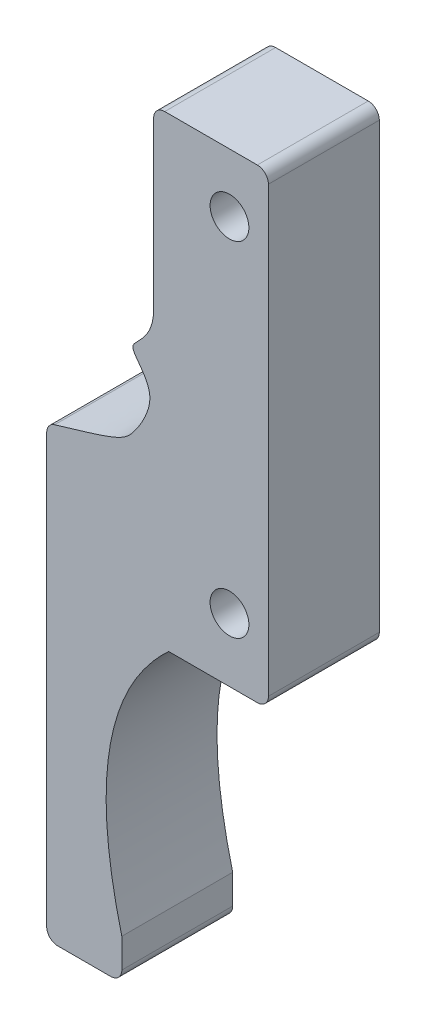
ISO-10303-21;
HEADER;
FILE_DESCRIPTION(('STEP AP214'),'2;1');
FILE_NAME('part.step','',(''),(''),'','','');
FILE_SCHEMA(('AUTOMOTIVE_DESIGN { 1 0 10303 214 1 1 1 1 }'));
ENDSEC;
DATA;
#1=APPLICATION_CONTEXT('core data for automotive mechanical design processes');
#2=APPLICATION_PROTOCOL_DEFINITION('international standard','automotive_design',2000,#1);
#3=PRODUCT_CONTEXT('',#1,'mechanical');
#4=PRODUCT('Part','Part','',(#3));
#5=PRODUCT_RELATED_PRODUCT_CATEGORY('part','',(#4));
#6=PRODUCT_DEFINITION_FORMATION('','',#4);
#7=PRODUCT_DEFINITION_CONTEXT('part definition',#1,'design');
#8=PRODUCT_DEFINITION('design','',#6,#7);
#9=PRODUCT_DEFINITION_SHAPE('','',#8);
#10=(LENGTH_UNIT() NAMED_UNIT(*) SI_UNIT(.MILLI.,.METRE.));
#11=(NAMED_UNIT(*) PLANE_ANGLE_UNIT() SI_UNIT($,.RADIAN.));
#12=(NAMED_UNIT(*) SI_UNIT($,.STERADIAN.) SOLID_ANGLE_UNIT());
#13=UNCERTAINTY_MEASURE_WITH_UNIT(LENGTH_MEASURE(1.E-05),#10,'distance_accuracy_value','');
#14=(GEOMETRIC_REPRESENTATION_CONTEXT(3) GLOBAL_UNCERTAINTY_ASSIGNED_CONTEXT((#13)) GLOBAL_UNIT_ASSIGNED_CONTEXT((#10,
#11,#12)) REPRESENTATION_CONTEXT('',''));
#15=CARTESIAN_POINT('',(0.,0.,0.));
#16=DIRECTION('',(0.,0.,1.));
#17=DIRECTION('',(1.,0.,0.));
#18=AXIS2_PLACEMENT_3D('',#15,#16,#17);
#19=CARTESIAN_POINT('',(81.4074976164815,110.958146332403,10.));
#20=DIRECTION('',(0.,0.,1.));
#21=DIRECTION('',(1.,0.,0.));
#22=AXIS2_PLACEMENT_3D('',#19,#20,#21);
#23=PLANE('',#22);
#24=CARTESIAN_POINT('',(78.8936057952045,106.672950268513,10.));
#25=DIRECTION('',(0.,0.,1.));
#26=DIRECTION('',(1.,0.,0.));
#27=AXIS2_PLACEMENT_3D('',#24,#25,#26);
#28=CIRCLE('',#27,1.75);
#29=CARTESIAN_POINT('',(80.6436057952045,106.672950268513,10.));
#30=VERTEX_POINT('',#29);
#31=EDGE_CURVE('E178',#30,#30,#28,.T.);
#32=ORIENTED_EDGE('',*,*,#31,.F.);
#33=EDGE_LOOP('',(#32));
#34=FACE_BOUND('',#33,.T.);
#35=CARTESIAN_POINT('',(81.4074976164815,110.958146332403,10.));
#36=DIRECTION('',(0.,0.,1.));
#37=DIRECTION('',(1.,0.,0.));
#38=AXIS2_PLACEMENT_3D('',#35,#36,#37);
#39=CIRCLE('',#38,1.);
#40=CARTESIAN_POINT('',(82.4074976164815,110.958146332403,10.));
#41=VERTEX_POINT('',#40);
#42=CARTESIAN_POINT('',(81.4074976164815,111.958146332403,10.));
#43=VERTEX_POINT('',#42);
#44=EDGE_CURVE('E213',#41,#43,#39,.T.);
#45=ORIENTED_EDGE('',*,*,#44,.T.);
#46=DIRECTION('',(-1.,0.,0.));
#47=VECTOR('',#46,1.);
#48=CARTESIAN_POINT('',(73.0536822358532,111.958146332403,10.));
#49=LINE('',#48,#47);
#50=CARTESIAN_POINT('',(73.0536822358532,111.958146332403,10.));
#51=VERTEX_POINT('',#50);
#52=EDGE_CURVE('E116',#43,#51,#49,.T.);
#53=ORIENTED_EDGE('',*,*,#52,.T.);
#54=CARTESIAN_POINT('',(73.0536822358532,110.958146332403,10.));
#55=DIRECTION('',(0.,0.,1.));
#56=DIRECTION('',(1.,0.,0.));
#57=AXIS2_PLACEMENT_3D('',#54,#55,#56);
#58=CIRCLE('',#57,1.);
#59=CARTESIAN_POINT('',(72.0536822358532,110.958146332403,10.));
#60=VERTEX_POINT('',#59);
#61=EDGE_CURVE('E249',#51,#60,#58,.T.);
#62=ORIENTED_EDGE('',*,*,#61,.T.);
#63=DIRECTION('',(0.,-1.,0.));
#64=VECTOR('',#63,1.);
#65=CARTESIAN_POINT('',(72.0536822358532,110.958146332403,10.));
#66=LINE('',#65,#64);
#67=CARTESIAN_POINT('',(72.0536822358532,96.0190924094982,10.));
#68=VERTEX_POINT('',#67);
#69=EDGE_CURVE('E268',#60,#68,#66,.T.);
#70=ORIENTED_EDGE('',*,*,#69,.T.);
#71=CARTESIAN_POINT('',(72.0536822358532,96.0190924094982,10.));
#72=CARTESIAN_POINT('',(72.0536822358532,93.5706000792391,10.));
#73=CARTESIAN_POINT('',(70.0021186185819,92.6664007553484,10.));
#74=CARTESIAN_POINT('',(70.3613429707541,91.3427097777105,10.));
#75=CARTESIAN_POINT('',(72.6197353641653,89.4424327734386,10.));
#76=CARTESIAN_POINT('',(70.7931183017576,86.1977075173196,10.));
#77=CARTESIAN_POINT('',(69.297708233434,84.3464227662319,10.));
#78=CARTESIAN_POINT('',(67.8216632749963,83.9233918157655,10.));
#79=CARTESIAN_POINT('',(63.1222194868842,82.5246168758891,10.));
#80=B_SPLINE_CURVE_WITH_KNOTS('',3,(#71,#72,#73,#74,#75,#76,#77,#78,#79),.UNSPECIFIED.,.F.,.F.,
(4,1,1,1,1,1,4),(0.0124698077563363,0.212188097159802,0.26070740571171,0.497662893275421,
0.694790388692906,0.745024099365364,1.),.UNSPECIFIED.);
#81=CARTESIAN_POINT('',(63.1222194868842,82.5246168758891,10.));
#82=VERTEX_POINT('',#81);
#83=EDGE_CURVE('E265',#68,#82,#80,.T.);
#84=ORIENTED_EDGE('',*,*,#83,.T.);
#85=CARTESIAN_POINT('',(63.4074976164816,81.5661720998204,10.));
#86=DIRECTION('',(0.,0.,1.));
#87=DIRECTION('',(-1.,0.,0.));
#88=AXIS2_PLACEMENT_3D('',#85,#86,#87);
#89=CIRCLE('',#88,1.00000000000003);
#90=CARTESIAN_POINT('',(62.4074976164815,81.5661720998204,10.));
#91=VERTEX_POINT('',#90);
#92=EDGE_CURVE('E267',#82,#91,#89,.T.);
#93=ORIENTED_EDGE('',*,*,#92,.T.);
#94=DIRECTION('',(0.,-1.,0.));
#95=VECTOR('',#94,1.);
#96=CARTESIAN_POINT('',(62.4074976164815,81.5661720998204,10.));
#97=LINE('',#96,#95);
#98=CARTESIAN_POINT('',(62.4074976164815,42.958146332403,10.));
#99=VERTEX_POINT('',#98);
#100=EDGE_CURVE('E270',#91,#99,#97,.T.);
#101=ORIENTED_EDGE('',*,*,#100,.T.);
#102=CARTESIAN_POINT('',(63.4074976164815,42.958146332403,10.));
#103=DIRECTION('',(0.,0.,1.));
#104=DIRECTION('',(-1.,0.,0.));
#105=AXIS2_PLACEMENT_3D('',#102,#103,#104);
#106=CIRCLE('',#105,0.999999999999994);
#107=CARTESIAN_POINT('',(63.4074976164815,41.958146332403,10.));
#108=VERTEX_POINT('',#107);
#109=EDGE_CURVE('E334',#99,#108,#106,.T.);
#110=ORIENTED_EDGE('',*,*,#109,.T.);
#111=DIRECTION('',(1.,0.,0.));
#112=VECTOR('',#111,1.);
#113=CARTESIAN_POINT('',(63.4074976164815,41.958146332403,10.));
#114=LINE('',#113,#112);
#115=CARTESIAN_POINT('',(68.1828282035285,41.9581463324029,10.));
#116=VERTEX_POINT('',#115);
#117=EDGE_CURVE('E332',#108,#116,#114,.T.);
#118=ORIENTED_EDGE('',*,*,#117,.T.);
#119=CARTESIAN_POINT('',(68.1828282035285,42.958146332403,10.));
#120=DIRECTION('',(0.,0.,1.));
#121=DIRECTION('',(1.,0.,0.));
#122=AXIS2_PLACEMENT_3D('',#119,#120,#121);
#123=CIRCLE('',#122,1.00000000000001);
#124=CARTESIAN_POINT('',(69.1828282035285,42.958146332403,10.));
#125=VERTEX_POINT('',#124);
#126=EDGE_CURVE('E330',#116,#125,#123,.T.);
#127=ORIENTED_EDGE('',*,*,#126,.T.);
#128=DIRECTION('',(0.,1.,0.));
#129=VECTOR('',#128,1.);
#130=CARTESIAN_POINT('',(69.1828282035285,42.958146332403,10.));
#131=LINE('',#130,#129);
#132=CARTESIAN_POINT('',(69.1828282035285,45.5999228236524,10.));
#133=VERTEX_POINT('',#132);
#134=EDGE_CURVE('E325',#125,#133,#131,.T.);
#135=ORIENTED_EDGE('',*,*,#134,.T.);
#136=CARTESIAN_POINT('',(69.1828282035285,45.5999228236524,10.));
#137=CARTESIAN_POINT('',(64.9461560401079,62.1314053742573,10.));
#138=CARTESIAN_POINT('',(73.4074976164815,69.9581463324029,10.));
#139=B_SPLINE_CURVE_WITH_KNOTS('',2,(#136,#137,#138),.UNSPECIFIED.,.F.,.F.,(3,3),(0.,1.),.UNSPECIFIED.);
#140=CARTESIAN_POINT('',(73.4074976164815,69.9581463324029,10.));
#141=VERTEX_POINT('',#140);
#142=EDGE_CURVE('E156',#133,#141,#139,.T.);
#143=ORIENTED_EDGE('',*,*,#142,.T.);
#144=DIRECTION('',(1.,0.,0.));
#145=VECTOR('',#144,1.);
#146=CARTESIAN_POINT('',(81.4074976164815,69.9581463324029,10.));
#147=LINE('',#146,#145);
#148=CARTESIAN_POINT('',(81.4074976164815,69.9581463324029,10.));
#149=VERTEX_POINT('',#148);
#150=EDGE_CURVE('E150',#141,#149,#147,.T.);
#151=ORIENTED_EDGE('',*,*,#150,.T.);
#152=CARTESIAN_POINT('',(81.4074976164815,70.9581463324029,10.));
#153=DIRECTION('',(0.,0.,1.));
#154=DIRECTION('',(1.,0.,0.));
#155=AXIS2_PLACEMENT_3D('',#152,#153,#154);
#156=CIRCLE('',#155,1.);
#157=CARTESIAN_POINT('',(82.4074976164815,70.9581463324029,10.));
#158=VERTEX_POINT('',#157);
#159=EDGE_CURVE('E154',#149,#158,#156,.T.);
#160=ORIENTED_EDGE('',*,*,#159,.T.);
#161=DIRECTION('',(0.,1.,0.));
#162=VECTOR('',#161,1.);
#163=CARTESIAN_POINT('',(82.4074976164815,110.958146332403,10.));
#164=LINE('',#163,#162);
#165=EDGE_CURVE('E52',#158,#41,#164,.T.);
#166=ORIENTED_EDGE('',*,*,#165,.T.);
#167=EDGE_LOOP('',(#45,#53,#62,#70,#84,#93,#101,#110,#118,#127,#135,#143,#151,#160,#166));
#168=FACE_BOUND('',#167,.T.);
#169=CARTESIAN_POINT('',(78.8936057952045,75.6729502685132,10.));
#170=DIRECTION('',(0.,0.,1.));
#171=DIRECTION('',(1.,0.,0.));
#172=AXIS2_PLACEMENT_3D('',#169,#170,#171);
#173=CIRCLE('',#172,1.75);
#174=CARTESIAN_POINT('',(80.6436057952045,75.6729502685132,10.));
#175=VERTEX_POINT('',#174);
#176=EDGE_CURVE('E369',#175,#175,#173,.T.);
#177=ORIENTED_EDGE('',*,*,#176,.F.);
#178=EDGE_LOOP('',(#177));
#179=FACE_BOUND('',#178,.T.);
#180=ADVANCED_FACE('F35',(#34,#168,#179),#23,.T.);
#181=CARTESIAN_POINT('',(81.4074976164815,110.958146332403,0.));
#182=DIRECTION('',(0.,0.,1.));
#183=DIRECTION('',(1.,0.,0.));
#184=AXIS2_PLACEMENT_3D('',#181,#182,#183);
#185=PLANE('',#184);
#186=CARTESIAN_POINT('',(81.4074976164815,110.958146332403,0.));
#187=DIRECTION('',(0.,0.,1.));
#188=DIRECTION('',(1.,0.,0.));
#189=AXIS2_PLACEMENT_3D('',#186,#187,#188);
#190=CIRCLE('',#189,1.);
#191=CARTESIAN_POINT('',(82.4074976164815,110.958146332403,0.));
#192=VERTEX_POINT('',#191);
#193=CARTESIAN_POINT('',(81.4074976164815,111.958146332403,0.));
#194=VERTEX_POINT('',#193);
#195=EDGE_CURVE('E174',#192,#194,#190,.T.);
#196=ORIENTED_EDGE('',*,*,#195,.F.);
#197=DIRECTION('',(0.,1.,0.));
#198=VECTOR('',#197,1.);
#199=CARTESIAN_POINT('',(82.4074976164815,110.958146332403,0.));
#200=LINE('',#199,#198);
#201=CARTESIAN_POINT('',(82.4074976164815,70.9581463324029,0.));
#202=VERTEX_POINT('',#201);
#203=EDGE_CURVE('E108',#202,#192,#200,.T.);
#204=ORIENTED_EDGE('',*,*,#203,.F.);
#205=CARTESIAN_POINT('',(81.4074976164815,70.9581463324029,0.));
#206=DIRECTION('',(0.,0.,1.));
#207=DIRECTION('',(1.,0.,0.));
#208=AXIS2_PLACEMENT_3D('',#205,#206,#207);
#209=CIRCLE('',#208,1.);
#210=CARTESIAN_POINT('',(81.4074976164815,69.9581463324029,0.));
#211=VERTEX_POINT('',#210);
#212=EDGE_CURVE('E102',#211,#202,#209,.T.);
#213=ORIENTED_EDGE('',*,*,#212,.F.);
#214=DIRECTION('',(1.,0.,0.));
#215=VECTOR('',#214,1.);
#216=CARTESIAN_POINT('',(81.4074976164815,69.9581463324029,0.));
#217=LINE('',#216,#215);
#218=CARTESIAN_POINT('',(73.4074976164815,69.9581463324029,0.));
#219=VERTEX_POINT('',#218);
#220=EDGE_CURVE('E164',#219,#211,#217,.T.);
#221=ORIENTED_EDGE('',*,*,#220,.F.);
#222=CARTESIAN_POINT('',(69.1828282035285,45.5999228236524,0.));
#223=CARTESIAN_POINT('',(64.9461560401079,62.1314053742573,0.));
#224=CARTESIAN_POINT('',(73.4074976164815,69.9581463324029,0.));
#225=B_SPLINE_CURVE_WITH_KNOTS('',2,(#222,#223,#224),.UNSPECIFIED.,.F.,.F.,(3,3),(0.,1.),.UNSPECIFIED.);
#226=CARTESIAN_POINT('',(69.1828282035285,45.5999228236524,0.));
#227=VERTEX_POINT('',#226);
#228=EDGE_CURVE('E203',#227,#219,#225,.T.);
#229=ORIENTED_EDGE('',*,*,#228,.F.);
#230=DIRECTION('',(0.,1.,0.));
#231=VECTOR('',#230,1.);
#232=CARTESIAN_POINT('',(69.1828282035285,42.958146332403,0.));
#233=LINE('',#232,#231);
#234=CARTESIAN_POINT('',(69.1828282035285,42.958146332403,0.));
#235=VERTEX_POINT('',#234);
#236=EDGE_CURVE('E201',#235,#227,#233,.T.);
#237=ORIENTED_EDGE('',*,*,#236,.F.);
#238=CARTESIAN_POINT('',(68.1828282035285,42.958146332403,0.));
#239=DIRECTION('',(0.,0.,1.));
#240=DIRECTION('',(1.,0.,0.));
#241=AXIS2_PLACEMENT_3D('',#238,#239,#240);
#242=CIRCLE('',#241,1.00000000000001);
#243=CARTESIAN_POINT('',(68.1828282035285,41.9581463324029,0.));
#244=VERTEX_POINT('',#243);
#245=EDGE_CURVE('E199',#244,#235,#242,.T.);
#246=ORIENTED_EDGE('',*,*,#245,.F.);
#247=DIRECTION('',(1.,0.,0.));
#248=VECTOR('',#247,1.);
#249=CARTESIAN_POINT('',(63.4074976164815,41.958146332403,0.));
#250=LINE('',#249,#248);
#251=CARTESIAN_POINT('',(63.4074976164815,41.958146332403,0.));
#252=VERTEX_POINT('',#251);
#253=EDGE_CURVE('E197',#252,#244,#250,.T.);
#254=ORIENTED_EDGE('',*,*,#253,.F.);
#255=CARTESIAN_POINT('',(63.4074976164815,42.958146332403,0.));
#256=DIRECTION('',(0.,0.,1.));
#257=DIRECTION('',(-1.,0.,0.));
#258=AXIS2_PLACEMENT_3D('',#255,#256,#257);
#259=CIRCLE('',#258,0.999999999999994);
#260=CARTESIAN_POINT('',(62.4074976164815,42.958146332403,0.));
#261=VERTEX_POINT('',#260);
#262=EDGE_CURVE('E195',#261,#252,#259,.T.);
#263=ORIENTED_EDGE('',*,*,#262,.F.);
#264=DIRECTION('',(0.,-1.,0.));
#265=VECTOR('',#264,1.);
#266=CARTESIAN_POINT('',(62.4074976164815,81.5661720998204,0.));
#267=LINE('',#266,#265);
#268=CARTESIAN_POINT('',(62.4074976164815,81.5661720998204,0.));
#269=VERTEX_POINT('',#268);
#270=EDGE_CURVE('E193',#269,#261,#267,.T.);
#271=ORIENTED_EDGE('',*,*,#270,.F.);
#272=CARTESIAN_POINT('',(63.4074976164816,81.5661720998204,0.));
#273=DIRECTION('',(0.,0.,1.));
#274=DIRECTION('',(-1.,0.,0.));
#275=AXIS2_PLACEMENT_3D('',#272,#273,#274);
#276=CIRCLE('',#275,1.00000000000003);
#277=CARTESIAN_POINT('',(63.1222194868842,82.5246168758891,0.));
#278=VERTEX_POINT('',#277);
#279=EDGE_CURVE('E188',#278,#269,#276,.T.);
#280=ORIENTED_EDGE('',*,*,#279,.F.);
#281=CARTESIAN_POINT('',(72.0536822358532,96.0190924094982,0.));
#282=CARTESIAN_POINT('',(72.0536822358532,93.5706000792391,0.));
#283=CARTESIAN_POINT('',(70.0021186185819,92.6664007553484,0.));
#284=CARTESIAN_POINT('',(70.3613429707541,91.3427097777105,0.));
#285=CARTESIAN_POINT('',(72.6197353641653,89.4424327734386,0.));
#286=CARTESIAN_POINT('',(70.7931183017576,86.1977075173196,0.));
#287=CARTESIAN_POINT('',(69.297708233434,84.3464227662319,0.));
#288=CARTESIAN_POINT('',(67.8216632749963,83.9233918157655,0.));
#289=CARTESIAN_POINT('',(63.1222194868842,82.5246168758891,0.));
#290=B_SPLINE_CURVE_WITH_KNOTS('',3,(#281,#282,#283,#284,#285,#286,#287,#288,#289),
.UNSPECIFIED.,.F.,.F.,(4,1,1,1,1,1,4),(0.0124698077563363,0.212188097159802,0.26070740571171,
0.497662893275421,0.694790388692906,0.745024099365364,1.),.UNSPECIFIED.);
#291=CARTESIAN_POINT('',(72.0536822358532,96.0190924094982,0.));
#292=VERTEX_POINT('',#291);
#293=EDGE_CURVE('E184',#292,#278,#290,.T.);
#294=ORIENTED_EDGE('',*,*,#293,.F.);
#295=DIRECTION('',(0.,-1.,0.));
#296=VECTOR('',#295,1.);
#297=CARTESIAN_POINT('',(72.0536822358532,110.958146332403,0.));
#298=LINE('',#297,#296);
#299=CARTESIAN_POINT('',(72.0536822358532,110.958146332403,0.));
#300=VERTEX_POINT('',#299);
#301=EDGE_CURVE('E182',#300,#292,#298,.T.);
#302=ORIENTED_EDGE('',*,*,#301,.F.);
#303=CARTESIAN_POINT('',(73.0536822358532,110.958146332403,0.));
#304=DIRECTION('',(0.,0.,1.));
#305=DIRECTION('',(1.,0.,0.));
#306=AXIS2_PLACEMENT_3D('',#303,#304,#305);
#307=CIRCLE('',#306,1.);
#308=CARTESIAN_POINT('',(73.0536822358532,111.958146332403,0.));
#309=VERTEX_POINT('',#308);
#310=EDGE_CURVE('E180',#309,#300,#307,.T.);
#311=ORIENTED_EDGE('',*,*,#310,.F.);
#312=DIRECTION('',(-1.,0.,0.));
#313=VECTOR('',#312,1.);
#314=CARTESIAN_POINT('',(73.0536822358532,111.958146332403,0.));
#315=LINE('',#314,#313);
#316=EDGE_CURVE('E177',#194,#309,#315,.T.);
#317=ORIENTED_EDGE('',*,*,#316,.F.);
#318=EDGE_LOOP('',(#196,#204,#213,#221,#229,#237,#246,#254,#263,#271,#280,#294,#302,#311,#317));
#319=FACE_BOUND('',#318,.T.);
#320=CARTESIAN_POINT('',(78.8936057952045,106.672950268513,0.));
#321=DIRECTION('',(0.,0.,1.));
#322=DIRECTION('',(1.,0.,0.));
#323=AXIS2_PLACEMENT_3D('',#320,#321,#322);
#324=CIRCLE('',#323,1.75);
#325=CARTESIAN_POINT('',(80.6436057952045,106.672950268513,0.));
#326=VERTEX_POINT('',#325);
#327=EDGE_CURVE('E366',#326,#326,#324,.T.);
#328=ORIENTED_EDGE('',*,*,#327,.T.);
#329=EDGE_LOOP('',(#328));
#330=FACE_BOUND('',#329,.T.);
#331=CARTESIAN_POINT('',(78.8936057952045,75.6729502685132,0.));
#332=DIRECTION('',(0.,0.,1.));
#333=DIRECTION('',(1.,0.,0.));
#334=AXIS2_PLACEMENT_3D('',#331,#332,#333);
#335=CIRCLE('',#334,1.75);
#336=CARTESIAN_POINT('',(80.6436057952045,75.6729502685132,0.));
#337=VERTEX_POINT('',#336);
#338=EDGE_CURVE('E372',#337,#337,#335,.T.);
#339=ORIENTED_EDGE('',*,*,#338,.T.);
#340=EDGE_LOOP('',(#339));
#341=FACE_BOUND('',#340,.T.);
#342=ADVANCED_FACE('F253',(#319,#330,#341),#185,.F.);
#343=CARTESIAN_POINT('',(81.4074976164815,110.958146332403,10.));
#344=DIRECTION('',(0.,0.,-1.));
#345=DIRECTION('',(-1.,0.,0.));
#346=AXIS2_PLACEMENT_3D('',#343,#344,#345);
#347=CYLINDRICAL_SURFACE('',#346,1.);
#348=ORIENTED_EDGE('',*,*,#195,.T.);
#349=DIRECTION('',(0.,0.,-1.));
#350=VECTOR('',#349,1.);
#351=CARTESIAN_POINT('',(81.4074976164815,111.958146332403,10.));
#352=LINE('',#351,#350);
#353=EDGE_CURVE('E11',#43,#194,#352,.T.);
#354=ORIENTED_EDGE('',*,*,#353,.F.);
#355=ORIENTED_EDGE('',*,*,#44,.F.);
#356=DIRECTION('',(0.,0.,-1.));
#357=VECTOR('',#356,1.);
#358=CARTESIAN_POINT('',(82.4074976164815,110.958146332403,10.));
#359=LINE('',#358,#357);
#360=EDGE_CURVE('E170',#41,#192,#359,.T.);
#361=ORIENTED_EDGE('',*,*,#360,.T.);
#362=EDGE_LOOP('',(#348,#354,#355,#361));
#363=FACE_BOUND('',#362,.T.);
#364=ADVANCED_FACE('F37',(#363),#347,.T.);
#365=CARTESIAN_POINT('',(73.0536822358532,111.958146332403,10.));
#366=DIRECTION('',(0.,-1.,0.));
#367=DIRECTION('',(0.,0.,-1.));
#368=AXIS2_PLACEMENT_3D('',#365,#366,#367);
#369=PLANE('',#368);
#370=ORIENTED_EDGE('',*,*,#316,.T.);
#371=DIRECTION('',(0.,0.,-1.));
#372=VECTOR('',#371,1.);
#373=CARTESIAN_POINT('',(73.0536822358532,111.958146332403,10.));
#374=LINE('',#373,#372);
#375=EDGE_CURVE('E44',#51,#309,#374,.T.);
#376=ORIENTED_EDGE('',*,*,#375,.F.);
#377=ORIENTED_EDGE('',*,*,#52,.F.);
#378=ORIENTED_EDGE('',*,*,#353,.T.);
#379=EDGE_LOOP('',(#370,#376,#377,#378));
#380=FACE_BOUND('',#379,.T.);
#381=ADVANCED_FACE('F290',(#380),#369,.F.);
#382=CARTESIAN_POINT('',(73.0536822358532,110.958146332403,10.));
#383=DIRECTION('',(0.,0.,-1.));
#384=DIRECTION('',(-1.,0.,0.));
#385=AXIS2_PLACEMENT_3D('',#382,#383,#384);
#386=CYLINDRICAL_SURFACE('',#385,1.);
#387=ORIENTED_EDGE('',*,*,#310,.T.);
#388=DIRECTION('',(0.,0.,-1.));
#389=VECTOR('',#388,1.);
#390=CARTESIAN_POINT('',(72.0536822358532,110.958146332403,10.));
#391=LINE('',#390,#389);
#392=EDGE_CURVE('E241',#60,#300,#391,.T.);
#393=ORIENTED_EDGE('',*,*,#392,.F.);
#394=ORIENTED_EDGE('',*,*,#61,.F.);
#395=ORIENTED_EDGE('',*,*,#375,.T.);
#396=EDGE_LOOP('',(#387,#393,#394,#395));
#397=FACE_BOUND('',#396,.T.);
#398=ADVANCED_FACE('F247',(#397),#386,.T.);
#399=CARTESIAN_POINT('',(72.0536822358532,110.958146332403,10.));
#400=DIRECTION('',(1.,0.,0.));
#401=DIRECTION('',(0.,0.,-1.));
#402=AXIS2_PLACEMENT_3D('',#399,#400,#401);
#403=PLANE('',#402);
#404=ORIENTED_EDGE('',*,*,#301,.T.);
#405=DIRECTION('',(0.,0.,-1.));
#406=VECTOR('',#405,1.);
#407=CARTESIAN_POINT('',(72.0536822358532,96.0190924094982,10.));
#408=LINE('',#407,#406);
#409=EDGE_CURVE('E238',#68,#292,#408,.T.);
#410=ORIENTED_EDGE('',*,*,#409,.F.);
#411=ORIENTED_EDGE('',*,*,#69,.F.);
#412=ORIENTED_EDGE('',*,*,#392,.T.);
#413=EDGE_LOOP('',(#404,#410,#411,#412));
#414=FACE_BOUND('',#413,.T.);
#415=ADVANCED_FACE('F259',(#414),#403,.F.);
#416=DIRECTION('',(0.,0.,-1.));
#417=VECTOR('',#416,1.);
#418=SURFACE_OF_LINEAR_EXTRUSION('',#80,#417);
#419=ORIENTED_EDGE('',*,*,#293,.T.);
#420=DIRECTION('',(0.,0.,-1.));
#421=VECTOR('',#420,1.);
#422=CARTESIAN_POINT('',(63.1222194868842,82.5246168758891,10.));
#423=LINE('',#422,#421);
#424=EDGE_CURVE('E235',#82,#278,#423,.T.);
#425=ORIENTED_EDGE('',*,*,#424,.F.);
#426=ORIENTED_EDGE('',*,*,#83,.F.);
#427=ORIENTED_EDGE('',*,*,#409,.T.);
#428=EDGE_LOOP('',(#419,#425,#426,#427));
#429=FACE_BOUND('',#428,.T.);
#430=ADVANCED_FACE('F263',(#429),#418,.F.);
#431=CARTESIAN_POINT('',(63.4074976164816,81.5661720998204,10.));
#432=DIRECTION('',(0.,0.,-1.));
#433=DIRECTION('',(-1.,0.,0.));
#434=AXIS2_PLACEMENT_3D('',#431,#432,#433);
#435=CYLINDRICAL_SURFACE('',#434,1.00000000000003);
#436=ORIENTED_EDGE('',*,*,#279,.T.);
#437=DIRECTION('',(0.,0.,-1.));
#438=VECTOR('',#437,1.);
#439=CARTESIAN_POINT('',(62.4074976164815,81.5661720998204,10.));
#440=LINE('',#439,#438);
#441=EDGE_CURVE('E232',#91,#269,#440,.T.);
#442=ORIENTED_EDGE('',*,*,#441,.F.);
#443=ORIENTED_EDGE('',*,*,#92,.F.);
#444=ORIENTED_EDGE('',*,*,#424,.T.);
#445=EDGE_LOOP('',(#436,#442,#443,#444));
#446=FACE_BOUND('',#445,.T.);
#447=ADVANCED_FACE('F285',(#446),#435,.T.);
#448=CARTESIAN_POINT('',(62.4074976164815,81.5661720998204,10.));
#449=DIRECTION('',(1.,0.,0.));
#450=DIRECTION('',(0.,1.,0.));
#451=AXIS2_PLACEMENT_3D('',#448,#449,#450);
#452=PLANE('',#451);
#453=ORIENTED_EDGE('',*,*,#270,.T.);
#454=DIRECTION('',(0.,0.,-1.));
#455=VECTOR('',#454,1.);
#456=CARTESIAN_POINT('',(62.4074976164815,42.958146332403,10.));
#457=LINE('',#456,#455);
#458=EDGE_CURVE('E229',#99,#261,#457,.T.);
#459=ORIENTED_EDGE('',*,*,#458,.F.);
#460=ORIENTED_EDGE('',*,*,#100,.F.);
#461=ORIENTED_EDGE('',*,*,#441,.T.);
#462=EDGE_LOOP('',(#453,#459,#460,#461));
#463=FACE_BOUND('',#462,.T.);
#464=ADVANCED_FACE('F341',(#463),#452,.F.);
#465=CARTESIAN_POINT('',(63.4074976164815,42.958146332403,10.));
#466=DIRECTION('',(0.,0.,-1.));
#467=DIRECTION('',(-1.,0.,0.));
#468=AXIS2_PLACEMENT_3D('',#465,#466,#467);
#469=CYLINDRICAL_SURFACE('',#468,0.999999999999994);
#470=ORIENTED_EDGE('',*,*,#262,.T.);
#471=DIRECTION('',(0.,0.,-1.));
#472=VECTOR('',#471,1.);
#473=CARTESIAN_POINT('',(63.4074976164815,41.958146332403,10.));
#474=LINE('',#473,#472);
#475=EDGE_CURVE('E226',#108,#252,#474,.T.);
#476=ORIENTED_EDGE('',*,*,#475,.F.);
#477=ORIENTED_EDGE('',*,*,#109,.F.);
#478=ORIENTED_EDGE('',*,*,#458,.T.);
#479=EDGE_LOOP('',(#470,#476,#477,#478));
#480=FACE_BOUND('',#479,.T.);
#481=ADVANCED_FACE('F345',(#480),#469,.T.);
#482=CARTESIAN_POINT('',(63.4074976164815,41.958146332403,10.));
#483=DIRECTION('',(0.,1.,0.));
#484=DIRECTION('',(0.,0.,1.));
#485=AXIS2_PLACEMENT_3D('',#482,#483,#484);
#486=PLANE('',#485);
#487=ORIENTED_EDGE('',*,*,#253,.T.);
#488=DIRECTION('',(0.,0.,-1.));
#489=VECTOR('',#488,1.);
#490=CARTESIAN_POINT('',(68.1828282035285,41.9581463324029,10.));
#491=LINE('',#490,#489);
#492=EDGE_CURVE('E223',#116,#244,#491,.T.);
#493=ORIENTED_EDGE('',*,*,#492,.F.);
#494=ORIENTED_EDGE('',*,*,#117,.F.);
#495=ORIENTED_EDGE('',*,*,#475,.T.);
#496=EDGE_LOOP('',(#487,#493,#494,#495));
#497=FACE_BOUND('',#496,.T.);
#498=ADVANCED_FACE('F350',(#497),#486,.F.);
#499=CARTESIAN_POINT('',(68.1828282035285,42.958146332403,10.));
#500=DIRECTION('',(0.,0.,-1.));
#501=DIRECTION('',(-1.,0.,0.));
#502=AXIS2_PLACEMENT_3D('',#499,#500,#501);
#503=CYLINDRICAL_SURFACE('',#502,1.00000000000001);
#504=ORIENTED_EDGE('',*,*,#245,.T.);
#505=DIRECTION('',(0.,0.,-1.));
#506=VECTOR('',#505,1.);
#507=CARTESIAN_POINT('',(69.1828282035285,42.958146332403,10.));
#508=LINE('',#507,#506);
#509=EDGE_CURVE('E220',#125,#235,#508,.T.);
#510=ORIENTED_EDGE('',*,*,#509,.F.);
#511=ORIENTED_EDGE('',*,*,#126,.F.);
#512=ORIENTED_EDGE('',*,*,#492,.T.);
#513=EDGE_LOOP('',(#504,#510,#511,#512));
#514=FACE_BOUND('',#513,.T.);
#515=ADVANCED_FACE('F356',(#514),#503,.T.);
#516=CARTESIAN_POINT('',(69.1828282035285,42.958146332403,10.));
#517=DIRECTION('',(-1.,0.,0.));
#518=DIRECTION('',(0.,-1.,0.));
#519=AXIS2_PLACEMENT_3D('',#516,#517,#518);
#520=PLANE('',#519);
#521=ORIENTED_EDGE('',*,*,#236,.T.);
#522=DIRECTION('',(0.,0.,-1.));
#523=VECTOR('',#522,1.);
#524=CARTESIAN_POINT('',(69.1828282035285,45.5999228236524,10.));
#525=LINE('',#524,#523);
#526=EDGE_CURVE('E217',#133,#227,#525,.T.);
#527=ORIENTED_EDGE('',*,*,#526,.F.);
#528=ORIENTED_EDGE('',*,*,#134,.F.);
#529=ORIENTED_EDGE('',*,*,#509,.T.);
#530=EDGE_LOOP('',(#521,#527,#528,#529));
#531=FACE_BOUND('',#530,.T.);
#532=ADVANCED_FACE('F318',(#531),#520,.F.);
#533=DIRECTION('',(0.,0.,-1.));
#534=VECTOR('',#533,1.);
#535=SURFACE_OF_LINEAR_EXTRUSION('',#139,#534);
#536=ORIENTED_EDGE('',*,*,#228,.T.);
#537=DIRECTION('',(0.,0.,-1.));
#538=VECTOR('',#537,1.);
#539=CARTESIAN_POINT('',(73.4074976164815,69.9581463324029,10.));
#540=LINE('',#539,#538);
#541=EDGE_CURVE('E165',#141,#219,#540,.T.);
#542=ORIENTED_EDGE('',*,*,#541,.F.);
#543=ORIENTED_EDGE('',*,*,#142,.F.);
#544=ORIENTED_EDGE('',*,*,#526,.T.);
#545=EDGE_LOOP('',(#536,#542,#543,#544));
#546=FACE_BOUND('',#545,.T.);
#547=ADVANCED_FACE('F315',(#546),#535,.F.);
#548=CARTESIAN_POINT('',(81.4074976164815,69.9581463324029,10.));
#549=DIRECTION('',(0.,1.,0.));
#550=DIRECTION('',(0.,0.,1.));
#551=AXIS2_PLACEMENT_3D('',#548,#549,#550);
#552=PLANE('',#551);
#553=ORIENTED_EDGE('',*,*,#220,.T.);
#554=DIRECTION('',(0.,0.,-1.));
#555=VECTOR('',#554,1.);
#556=CARTESIAN_POINT('',(81.4074976164815,69.9581463324029,10.));
#557=LINE('',#556,#555);
#558=EDGE_CURVE('E161',#149,#211,#557,.T.);
#559=ORIENTED_EDGE('',*,*,#558,.F.);
#560=ORIENTED_EDGE('',*,*,#150,.F.);
#561=ORIENTED_EDGE('',*,*,#541,.T.);
#562=EDGE_LOOP('',(#553,#559,#560,#561));
#563=FACE_BOUND('',#562,.T.);
#564=ADVANCED_FACE('F162',(#563),#552,.F.);
#565=CARTESIAN_POINT('',(81.4074976164815,70.9581463324029,10.));
#566=DIRECTION('',(0.,0.,-1.));
#567=DIRECTION('',(-1.,0.,0.));
#568=AXIS2_PLACEMENT_3D('',#565,#566,#567);
#569=CYLINDRICAL_SURFACE('',#568,1.);
#570=ORIENTED_EDGE('',*,*,#212,.T.);
#571=DIRECTION('',(0.,0.,-1.));
#572=VECTOR('',#571,1.);
#573=CARTESIAN_POINT('',(82.4074976164815,70.9581463324029,10.));
#574=LINE('',#573,#572);
#575=EDGE_CURVE('E166',#158,#202,#574,.T.);
#576=ORIENTED_EDGE('',*,*,#575,.F.);
#577=ORIENTED_EDGE('',*,*,#159,.F.);
#578=ORIENTED_EDGE('',*,*,#558,.T.);
#579=EDGE_LOOP('',(#570,#576,#577,#578));
#580=FACE_BOUND('',#579,.T.);
#581=ADVANCED_FACE('F168',(#580),#569,.T.);
#582=CARTESIAN_POINT('',(82.4074976164815,110.958146332403,10.));
#583=DIRECTION('',(-1.,0.,0.));
#584=DIRECTION('',(0.,0.,1.));
#585=AXIS2_PLACEMENT_3D('',#582,#583,#584);
#586=PLANE('',#585);
#587=ORIENTED_EDGE('',*,*,#203,.T.);
#588=ORIENTED_EDGE('',*,*,#360,.F.);
#589=ORIENTED_EDGE('',*,*,#165,.F.);
#590=ORIENTED_EDGE('',*,*,#575,.T.);
#591=EDGE_LOOP('',(#587,#588,#589,#590));
#592=FACE_BOUND('',#591,.T.);
#593=ADVANCED_FACE('F308',(#592),#586,.F.);
#594=CARTESIAN_POINT('',(78.8936057952045,106.672950268513,10.));
#595=DIRECTION('',(0.,0.,-1.));
#596=DIRECTION('',(-1.,0.,0.));
#597=AXIS2_PLACEMENT_3D('',#594,#595,#596);
#598=CYLINDRICAL_SURFACE('',#597,1.75);
#599=ORIENTED_EDGE('',*,*,#31,.T.);
#600=EDGE_LOOP('',(#599));
#601=FACE_BOUND('',#600,.T.);
#602=ORIENTED_EDGE('',*,*,#327,.F.);
#603=EDGE_LOOP('',(#602));
#604=FACE_BOUND('',#603,.T.);
#605=ADVANCED_FACE('F305',(#601,#604),#598,.F.);
#606=CARTESIAN_POINT('',(78.8936057952045,75.6729502685132,10.));
#607=DIRECTION('',(0.,0.,-1.));
#608=DIRECTION('',(-1.,0.,0.));
#609=AXIS2_PLACEMENT_3D('',#606,#607,#608);
#610=CYLINDRICAL_SURFACE('',#609,1.75);
#611=ORIENTED_EDGE('',*,*,#176,.T.);
#612=EDGE_LOOP('',(#611));
#613=FACE_BOUND('',#612,.T.);
#614=ORIENTED_EDGE('',*,*,#338,.F.);
#615=EDGE_LOOP('',(#614));
#616=FACE_BOUND('',#615,.T.);
#617=ADVANCED_FACE('F378',(#613,#616),#610,.F.);
#618=CLOSED_SHELL('',(#180,#342,#364,#381,#398,#415,#430,#447,#464,#481,#498,#515,#532,#547,
#564,#581,#593,#605,#617));
#619=MANIFOLD_SOLID_BREP('B2',#618);
#620=ADVANCED_BREP_SHAPE_REPRESENTATION('',(#18,#619),#14);
#621=SHAPE_DEFINITION_REPRESENTATION(#9,#620);
ENDSEC;
END-ISO-10303-21;
